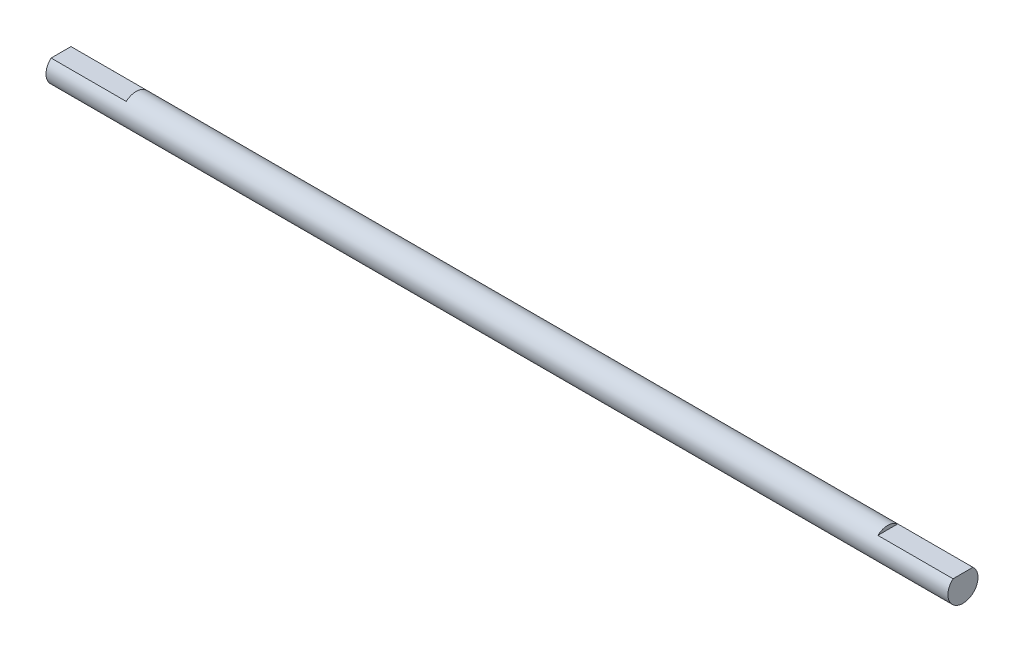
ISO-10303-21;
HEADER;
FILE_DESCRIPTION(('STEP AP214'),'2;1');
FILE_NAME('part.step','',(''),(''),'','','');
FILE_SCHEMA(('AUTOMOTIVE_DESIGN { 1 0 10303 214 1 1 1 1 }'));
ENDSEC;
DATA;
#1=APPLICATION_CONTEXT('core data for automotive mechanical design processes');
#2=APPLICATION_PROTOCOL_DEFINITION('international standard','automotive_design',2000,#1);
#3=PRODUCT_CONTEXT('',#1,'mechanical');
#4=PRODUCT('Part','Part','',(#3));
#5=PRODUCT_RELATED_PRODUCT_CATEGORY('part','',(#4));
#6=PRODUCT_DEFINITION_FORMATION('','',#4);
#7=PRODUCT_DEFINITION_CONTEXT('part definition',#1,'design');
#8=PRODUCT_DEFINITION('design','',#6,#7);
#9=PRODUCT_DEFINITION_SHAPE('','',#8);
#10=(LENGTH_UNIT() NAMED_UNIT(*) SI_UNIT(.MILLI.,.METRE.));
#11=(NAMED_UNIT(*) PLANE_ANGLE_UNIT() SI_UNIT($,.RADIAN.));
#12=(NAMED_UNIT(*) SI_UNIT($,.STERADIAN.) SOLID_ANGLE_UNIT());
#13=UNCERTAINTY_MEASURE_WITH_UNIT(LENGTH_MEASURE(1.E-05),#10,'distance_accuracy_value','');
#14=(GEOMETRIC_REPRESENTATION_CONTEXT(3) GLOBAL_UNCERTAINTY_ASSIGNED_CONTEXT((#13)) GLOBAL_UNIT_ASSIGNED_CONTEXT((#10,
#11,#12)) REPRESENTATION_CONTEXT('',''));
#15=CARTESIAN_POINT('',(0.,0.,0.));
#16=DIRECTION('',(0.,0.,1.));
#17=DIRECTION('',(1.,0.,0.));
#18=AXIS2_PLACEMENT_3D('',#15,#16,#17);
#19=CARTESIAN_POINT('',(60.,1.5,1.3228756555323));
#20=DIRECTION('',(0.,-1.,0.));
#21=DIRECTION('',(0.,0.,-1.));
#22=AXIS2_PLACEMENT_3D('',#19,#20,#21);
#23=PLANE('',#22);
#24=DIRECTION('',(0.,0.,1.));
#25=VECTOR('',#24,1.);
#26=CARTESIAN_POINT('',(-50.,1.5,1.3228756555323));
#27=LINE('',#26,#25);
#28=CARTESIAN_POINT('',(-50.,1.5,-1.3228756555323));
#29=VERTEX_POINT('',#28);
#30=CARTESIAN_POINT('',(-50.,1.5,1.3228756555323));
#31=VERTEX_POINT('',#30);
#32=EDGE_CURVE('E54',#29,#31,#27,.T.);
#33=ORIENTED_EDGE('',*,*,#32,.F.);
#34=DIRECTION('',(-1.,0.,0.));
#35=VECTOR('',#34,1.);
#36=CARTESIAN_POINT('',(60.,1.5,-1.3228756555323));
#37=LINE('',#36,#35);
#38=CARTESIAN_POINT('',(-60.,1.5,-1.3228756555323));
#39=VERTEX_POINT('',#38);
#40=EDGE_CURVE('E99',#29,#39,#37,.T.);
#41=ORIENTED_EDGE('',*,*,#40,.T.);
#42=DIRECTION('',(0.,0.,1.));
#43=VECTOR('',#42,1.);
#44=CARTESIAN_POINT('',(-60.,1.5,1.3228756555323));
#45=LINE('',#44,#43);
#46=CARTESIAN_POINT('',(-60.,1.5,1.3228756555323));
#47=VERTEX_POINT('',#46);
#48=EDGE_CURVE('E85',#39,#47,#45,.T.);
#49=ORIENTED_EDGE('',*,*,#48,.T.);
#50=DIRECTION('',(-1.,0.,0.));
#51=VECTOR('',#50,1.);
#52=CARTESIAN_POINT('',(60.,1.5,1.3228756555323));
#53=LINE('',#52,#51);
#54=EDGE_CURVE('E83',#31,#47,#53,.T.);
#55=ORIENTED_EDGE('',*,*,#54,.F.);
#56=EDGE_LOOP('',(#33,#41,#49,#55));
#57=FACE_BOUND('',#56,.T.);
#58=ADVANCED_FACE('F45',(#57),#23,.F.);
#59=CARTESIAN_POINT('',(60.,0.,0.));
#60=DIRECTION('',(-1.,0.,0.));
#61=DIRECTION('',(0.,0.,1.));
#62=AXIS2_PLACEMENT_3D('',#59,#60,#61);
#63=CYLINDRICAL_SURFACE('',#62,2.);
#64=CARTESIAN_POINT('',(60.,1.5,1.3228756555323));
#65=VERTEX_POINT('',#64);
#66=CARTESIAN_POINT('',(50.,1.5,1.3228756555323));
#67=VERTEX_POINT('',#66);
#68=EDGE_CURVE('E91',#65,#67,#53,.T.);
#69=ORIENTED_EDGE('',*,*,#68,.T.);
#70=CARTESIAN_POINT('',(50.,0.,0.));
#71=DIRECTION('',(1.,0.,0.));
#72=DIRECTION('',(0.,0.,-1.));
#73=AXIS2_PLACEMENT_3D('',#70,#71,#72);
#74=CIRCLE('',#73,2.);
#75=CARTESIAN_POINT('',(50.,1.5,-1.3228756555323));
#76=VERTEX_POINT('',#75);
#77=EDGE_CURVE('E101',#76,#67,#74,.T.);
#78=ORIENTED_EDGE('',*,*,#77,.F.);
#79=CARTESIAN_POINT('',(60.,1.5,-1.3228756555323));
#80=VERTEX_POINT('',#79);
#81=EDGE_CURVE('E67',#80,#76,#37,.T.);
#82=ORIENTED_EDGE('',*,*,#81,.F.);
#83=CARTESIAN_POINT('',(60.,0.,0.));
#84=DIRECTION('',(1.,0.,0.));
#85=DIRECTION('',(0.,0.,-1.));
#86=AXIS2_PLACEMENT_3D('',#83,#84,#85);
#87=CIRCLE('',#86,2.);
#88=EDGE_CURVE('E108',#65,#80,#87,.T.);
#89=ORIENTED_EDGE('',*,*,#88,.F.);
#90=EDGE_LOOP('',(#69,#78,#82,#89));
#91=FACE_BOUND('',#90,.T.);
#92=ORIENTED_EDGE('',*,*,#40,.F.);
#93=CARTESIAN_POINT('',(-50.,0.,0.));
#94=DIRECTION('',(1.,0.,0.));
#95=DIRECTION('',(0.,0.,-1.));
#96=AXIS2_PLACEMENT_3D('',#93,#94,#95);
#97=CIRCLE('',#96,2.);
#98=EDGE_CURVE('E97',#29,#31,#97,.T.);
#99=ORIENTED_EDGE('',*,*,#98,.T.);
#100=ORIENTED_EDGE('',*,*,#54,.T.);
#101=CARTESIAN_POINT('',(-60.,0.,0.));
#102=DIRECTION('',(1.,0.,0.));
#103=DIRECTION('',(0.,0.,-1.));
#104=AXIS2_PLACEMENT_3D('',#101,#102,#103);
#105=CIRCLE('',#104,2.);
#106=EDGE_CURVE('E105',#47,#39,#105,.T.);
#107=ORIENTED_EDGE('',*,*,#106,.T.);
#108=EDGE_LOOP('',(#92,#99,#100,#107));
#109=FACE_BOUND('',#108,.T.);
#110=ADVANCED_FACE('F47',(#91,#109),#63,.T.);
#111=ORIENTED_EDGE('',*,*,#81,.T.);
#112=DIRECTION('',(0.,0.,1.));
#113=VECTOR('',#112,1.);
#114=CARTESIAN_POINT('',(50.,1.5,1.3228756555323));
#115=LINE('',#114,#113);
#116=EDGE_CURVE('E11',#76,#67,#115,.T.);
#117=ORIENTED_EDGE('',*,*,#116,.T.);
#118=ORIENTED_EDGE('',*,*,#68,.F.);
#119=DIRECTION('',(0.,0.,1.));
#120=VECTOR('',#119,1.);
#121=CARTESIAN_POINT('',(60.,1.5,1.3228756555323));
#122=LINE('',#121,#120);
#123=EDGE_CURVE('E92',#80,#65,#122,.T.);
#124=ORIENTED_EDGE('',*,*,#123,.F.);
#125=EDGE_LOOP('',(#111,#117,#118,#124));
#126=FACE_BOUND('',#125,.T.);
#127=ADVANCED_FACE('F135',(#126),#23,.F.);
#128=CARTESIAN_POINT('',(60.,0.,0.));
#129=DIRECTION('',(1.,0.,0.));
#130=DIRECTION('',(0.,0.,-1.));
#131=AXIS2_PLACEMENT_3D('',#128,#129,#130);
#132=PLANE('',#131);
#133=ORIENTED_EDGE('',*,*,#88,.T.);
#134=ORIENTED_EDGE('',*,*,#123,.T.);
#135=EDGE_LOOP('',(#133,#134));
#136=FACE_BOUND('',#135,.T.);
#137=ADVANCED_FACE('F126',(#136),#132,.T.);
#138=CARTESIAN_POINT('',(-60.,0.,0.));
#139=DIRECTION('',(1.,0.,0.));
#140=DIRECTION('',(0.,0.,-1.));
#141=AXIS2_PLACEMENT_3D('',#138,#139,#140);
#142=PLANE('',#141);
#143=ORIENTED_EDGE('',*,*,#106,.F.);
#144=ORIENTED_EDGE('',*,*,#48,.F.);
#145=EDGE_LOOP('',(#143,#144));
#146=FACE_BOUND('',#145,.T.);
#147=ADVANCED_FACE('F123',(#146),#142,.F.);
#148=CARTESIAN_POINT('',(50.,0.,0.));
#149=DIRECTION('',(1.,0.,0.));
#150=DIRECTION('',(0.,0.,-1.));
#151=AXIS2_PLACEMENT_3D('',#148,#149,#150);
#152=PLANE('',#151);
#153=ORIENTED_EDGE('',*,*,#116,.F.);
#154=ORIENTED_EDGE('',*,*,#77,.T.);
#155=EDGE_LOOP('',(#153,#154));
#156=FACE_BOUND('',#155,.T.);
#157=ADVANCED_FACE('F125',(#156),#152,.T.);
#158=CARTESIAN_POINT('',(-50.,0.,0.));
#159=DIRECTION('',(1.,0.,0.));
#160=DIRECTION('',(0.,0.,-1.));
#161=AXIS2_PLACEMENT_3D('',#158,#159,#160);
#162=PLANE('',#161);
#163=ORIENTED_EDGE('',*,*,#98,.F.);
#164=ORIENTED_EDGE('',*,*,#32,.T.);
#165=EDGE_LOOP('',(#163,#164));
#166=FACE_BOUND('',#165,.T.);
#167=ADVANCED_FACE('F96',(#166),#162,.F.);
#168=CLOSED_SHELL('',(#58,#110,#127,#137,#147,#157,#167));
#169=MANIFOLD_SOLID_BREP('B2',#168);
#170=ADVANCED_BREP_SHAPE_REPRESENTATION('',(#18,#169),#14);
#171=SHAPE_DEFINITION_REPRESENTATION(#9,#170);
ENDSEC;
END-ISO-10303-21;
